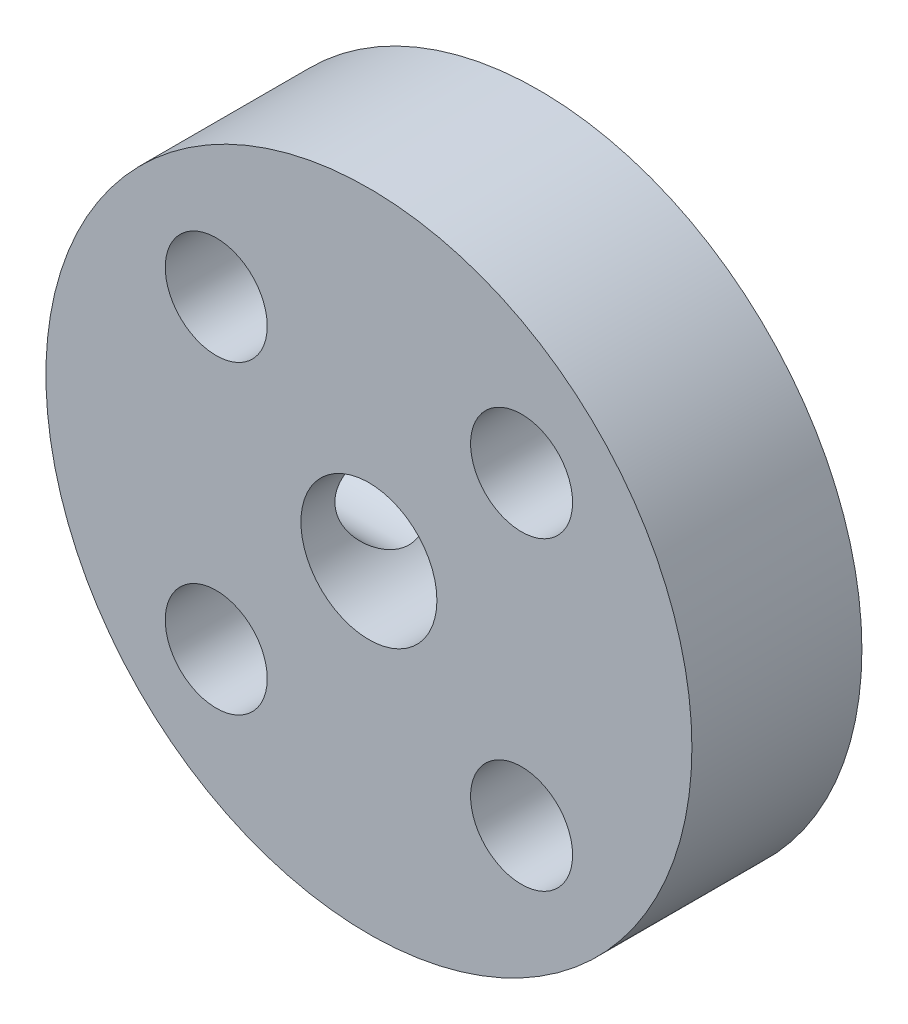
ISO-10303-21;
HEADER;
FILE_DESCRIPTION(('STEP AP214'),'2;1');
FILE_NAME('part.step','',(''),(''),'','','');
FILE_SCHEMA(('AUTOMOTIVE_DESIGN { 1 0 10303 214 1 1 1 1 }'));
ENDSEC;
DATA;
#1=APPLICATION_CONTEXT('core data for automotive mechanical design processes');
#2=APPLICATION_PROTOCOL_DEFINITION('international standard','automotive_design',2000,#1);
#3=PRODUCT_CONTEXT('',#1,'mechanical');
#4=PRODUCT('Part','Part','',(#3));
#5=PRODUCT_RELATED_PRODUCT_CATEGORY('part','',(#4));
#6=PRODUCT_DEFINITION_FORMATION('','',#4);
#7=PRODUCT_DEFINITION_CONTEXT('part definition',#1,'design');
#8=PRODUCT_DEFINITION('design','',#6,#7);
#9=PRODUCT_DEFINITION_SHAPE('','',#8);
#10=(LENGTH_UNIT() NAMED_UNIT(*) SI_UNIT(.MILLI.,.METRE.));
#11=(NAMED_UNIT(*) PLANE_ANGLE_UNIT() SI_UNIT($,.RADIAN.));
#12=(NAMED_UNIT(*) SI_UNIT($,.STERADIAN.) SOLID_ANGLE_UNIT());
#13=UNCERTAINTY_MEASURE_WITH_UNIT(LENGTH_MEASURE(1.E-05),#10,'distance_accuracy_value','');
#14=(GEOMETRIC_REPRESENTATION_CONTEXT(3) GLOBAL_UNCERTAINTY_ASSIGNED_CONTEXT((#13)) GLOBAL_UNIT_ASSIGNED_CONTEXT((#10,
#11,#12)) REPRESENTATION_CONTEXT('',''));
#15=CARTESIAN_POINT('',(0.,0.,0.));
#16=DIRECTION('',(0.,0.,1.));
#17=DIRECTION('',(1.,0.,0.));
#18=AXIS2_PLACEMENT_3D('',#15,#16,#17);
#19=CARTESIAN_POINT('',(0.,0.,2.5));
#20=DIRECTION('',(0.,0.,1.));
#21=DIRECTION('',(1.,0.,0.));
#22=AXIS2_PLACEMENT_3D('',#19,#20,#21);
#23=PLANE('',#22);
#24=CARTESIAN_POINT('',(-4.4901280605346,4.49012806053455,2.5));
#25=DIRECTION('',(0.,0.,1.));
#26=DIRECTION('',(1.,0.,0.));
#27=AXIS2_PLACEMENT_3D('',#24,#25,#26);
#28=CIRCLE('',#27,1.5);
#29=CARTESIAN_POINT('',(-2.9901280605346,4.49012806053455,2.5));
#30=VERTEX_POINT('',#29);
#31=EDGE_CURVE('E67',#30,#30,#28,.T.);
#32=ORIENTED_EDGE('',*,*,#31,.F.);
#33=EDGE_LOOP('',(#32));
#34=FACE_BOUND('',#33,.T.);
#35=CARTESIAN_POINT('',(4.49012806053454,4.49012806053462,2.5));
#36=DIRECTION('',(0.,0.,1.));
#37=DIRECTION('',(1.,0.,0.));
#38=AXIS2_PLACEMENT_3D('',#35,#36,#37);
#39=CIRCLE('',#38,1.5);
#40=CARTESIAN_POINT('',(5.99012806053454,4.49012806053462,2.5));
#41=VERTEX_POINT('',#40);
#42=EDGE_CURVE('E55',#41,#41,#39,.T.);
#43=ORIENTED_EDGE('',*,*,#42,.F.);
#44=EDGE_LOOP('',(#43));
#45=FACE_BOUND('',#44,.T.);
#46=CARTESIAN_POINT('',(0.,0.,2.5));
#47=DIRECTION('',(0.,0.,1.));
#48=DIRECTION('',(1.,0.,0.));
#49=AXIS2_PLACEMENT_3D('',#46,#47,#48);
#50=CIRCLE('',#49,9.5);
#51=CARTESIAN_POINT('',(9.5,0.,2.5));
#52=VERTEX_POINT('',#51);
#53=EDGE_CURVE('E10',#52,#52,#50,.T.);
#54=ORIENTED_EDGE('',*,*,#53,.T.);
#55=EDGE_LOOP('',(#54));
#56=FACE_BOUND('',#55,.T.);
#57=CARTESIAN_POINT('',(0.,0.,2.5));
#58=DIRECTION('',(0.,0.,1.));
#59=DIRECTION('',(1.,0.,0.));
#60=AXIS2_PLACEMENT_3D('',#57,#58,#59);
#61=CIRCLE('',#60,2.);
#62=CARTESIAN_POINT('',(2.,0.,2.5));
#63=VERTEX_POINT('',#62);
#64=EDGE_CURVE('E50',#63,#63,#61,.T.);
#65=ORIENTED_EDGE('',*,*,#64,.F.);
#66=EDGE_LOOP('',(#65));
#67=FACE_BOUND('',#66,.T.);
#68=CARTESIAN_POINT('',(4.4901280605346,-4.49012806053455,2.5));
#69=DIRECTION('',(0.,0.,1.));
#70=DIRECTION('',(1.,0.,0.));
#71=AXIS2_PLACEMENT_3D('',#68,#69,#70);
#72=CIRCLE('',#71,1.5);
#73=CARTESIAN_POINT('',(5.9901280605346,-4.49012806053455,2.5));
#74=VERTEX_POINT('',#73);
#75=EDGE_CURVE('E61',#74,#74,#72,.T.);
#76=ORIENTED_EDGE('',*,*,#75,.F.);
#77=EDGE_LOOP('',(#76));
#78=FACE_BOUND('',#77,.T.);
#79=CARTESIAN_POINT('',(-4.49012806053453,-4.49012806053462,2.5));
#80=DIRECTION('',(0.,0.,1.));
#81=DIRECTION('',(1.,0.,0.));
#82=AXIS2_PLACEMENT_3D('',#79,#80,#81);
#83=CIRCLE('',#82,1.5);
#84=CARTESIAN_POINT('',(-2.99012806053453,-4.49012806053462,2.5));
#85=VERTEX_POINT('',#84);
#86=EDGE_CURVE('E73',#85,#85,#83,.T.);
#87=ORIENTED_EDGE('',*,*,#86,.F.);
#88=EDGE_LOOP('',(#87));
#89=FACE_BOUND('',#88,.T.);
#90=ADVANCED_FACE('F31',(#34,#45,#56,#67,#78,#89),#23,.T.);
#91=CARTESIAN_POINT('',(0.,0.,-2.5));
#92=DIRECTION('',(0.,0.,1.));
#93=DIRECTION('',(1.,0.,0.));
#94=AXIS2_PLACEMENT_3D('',#91,#92,#93);
#95=PLANE('',#94);
#96=CARTESIAN_POINT('',(0.,0.,-2.5));
#97=DIRECTION('',(0.,0.,1.));
#98=DIRECTION('',(1.,0.,0.));
#99=AXIS2_PLACEMENT_3D('',#96,#97,#98);
#100=CIRCLE('',#99,9.5);
#101=CARTESIAN_POINT('',(9.5,0.,-2.5));
#102=VERTEX_POINT('',#101);
#103=EDGE_CURVE('E45',#102,#102,#100,.T.);
#104=ORIENTED_EDGE('',*,*,#103,.F.);
#105=EDGE_LOOP('',(#104));
#106=FACE_BOUND('',#105,.T.);
#107=CARTESIAN_POINT('',(0.,0.,-2.5));
#108=DIRECTION('',(0.,0.,1.));
#109=DIRECTION('',(1.,0.,0.));
#110=AXIS2_PLACEMENT_3D('',#107,#108,#109);
#111=CIRCLE('',#110,2.);
#112=CARTESIAN_POINT('',(2.,0.,-2.5));
#113=VERTEX_POINT('',#112);
#114=EDGE_CURVE('E52',#113,#113,#111,.T.);
#115=ORIENTED_EDGE('',*,*,#114,.T.);
#116=EDGE_LOOP('',(#115));
#117=FACE_BOUND('',#116,.T.);
#118=CARTESIAN_POINT('',(4.49012806053454,4.49012806053462,-2.5));
#119=DIRECTION('',(0.,0.,1.));
#120=DIRECTION('',(1.,0.,0.));
#121=AXIS2_PLACEMENT_3D('',#118,#119,#120);
#122=CIRCLE('',#121,1.5);
#123=CARTESIAN_POINT('',(5.99012806053454,4.49012806053462,-2.5));
#124=VERTEX_POINT('',#123);
#125=EDGE_CURVE('E58',#124,#124,#122,.T.);
#126=ORIENTED_EDGE('',*,*,#125,.T.);
#127=EDGE_LOOP('',(#126));
#128=FACE_BOUND('',#127,.T.);
#129=CARTESIAN_POINT('',(4.4901280605346,-4.49012806053455,-2.5));
#130=DIRECTION('',(0.,0.,1.));
#131=DIRECTION('',(1.,0.,0.));
#132=AXIS2_PLACEMENT_3D('',#129,#130,#131);
#133=CIRCLE('',#132,1.5);
#134=CARTESIAN_POINT('',(5.9901280605346,-4.49012806053455,-2.5));
#135=VERTEX_POINT('',#134);
#136=EDGE_CURVE('E64',#135,#135,#133,.T.);
#137=ORIENTED_EDGE('',*,*,#136,.T.);
#138=EDGE_LOOP('',(#137));
#139=FACE_BOUND('',#138,.T.);
#140=CARTESIAN_POINT('',(-4.4901280605346,4.49012806053455,-2.5));
#141=DIRECTION('',(0.,0.,1.));
#142=DIRECTION('',(1.,0.,0.));
#143=AXIS2_PLACEMENT_3D('',#140,#141,#142);
#144=CIRCLE('',#143,1.5);
#145=CARTESIAN_POINT('',(-2.9901280605346,4.49012806053455,-2.5));
#146=VERTEX_POINT('',#145);
#147=EDGE_CURVE('E70',#146,#146,#144,.T.);
#148=ORIENTED_EDGE('',*,*,#147,.T.);
#149=EDGE_LOOP('',(#148));
#150=FACE_BOUND('',#149,.T.);
#151=CARTESIAN_POINT('',(-4.49012806053453,-4.49012806053462,-2.5));
#152=DIRECTION('',(0.,0.,1.));
#153=DIRECTION('',(1.,0.,0.));
#154=AXIS2_PLACEMENT_3D('',#151,#152,#153);
#155=CIRCLE('',#154,1.5);
#156=CARTESIAN_POINT('',(-2.99012806053453,-4.49012806053462,-2.5));
#157=VERTEX_POINT('',#156);
#158=EDGE_CURVE('E76',#157,#157,#155,.T.);
#159=ORIENTED_EDGE('',*,*,#158,.T.);
#160=EDGE_LOOP('',(#159));
#161=FACE_BOUND('',#160,.T.);
#162=ADVANCED_FACE('F113',(#106,#117,#128,#139,#150,#161),#95,.F.);
#163=CARTESIAN_POINT('',(0.,0.,2.5));
#164=DIRECTION('',(0.,0.,-1.));
#165=DIRECTION('',(-1.,0.,0.));
#166=AXIS2_PLACEMENT_3D('',#163,#164,#165);
#167=CYLINDRICAL_SURFACE('',#166,9.5);
#168=CARTESIAN_POINT('',(-9.5,0.,1.5));
#169=CARTESIAN_POINT('',(-9.49999861203618,-0.0836976001065212,1.49999659075089));
#170=CARTESIAN_POINT('',(-9.49888234231911,-0.167442437394015,1.49297105489717));
#171=CARTESIAN_POINT('',(-9.49453678011784,-0.332587635211273,1.46506375653031));
#172=CARTESIAN_POINT('',(-9.49130548294469,-0.41398569489526,1.44416884792844));
#173=CARTESIAN_POINT('',(-9.48309267200424,-0.572023766729428,1.38916582150304));
#174=CARTESIAN_POINT('',(-9.47811253172856,-0.648667457404599,1.35506807066557));
#175=CARTESIAN_POINT('',(-9.46695108120927,-0.795134710469112,1.27465345446147));
#176=CARTESIAN_POINT('',(-9.46076992418343,-0.864959141108908,1.22833814746046));
#177=CARTESIAN_POINT('',(-9.44783324384052,-0.996418466512016,1.12437811450022));
#178=CARTESIAN_POINT('',(-9.44107365911177,-1.05798606000114,1.06664878123631));
#179=CARTESIAN_POINT('',(-9.4277734333424,-1.17060304704613,0.941681518294073));
#180=CARTESIAN_POINT('',(-9.42123280546741,-1.22165180906462,0.874443018105818));
#181=CARTESIAN_POINT('',(-9.40907168619828,-1.31204764005015,0.731909155530542));
#182=CARTESIAN_POINT('',(-9.40345644380092,-1.35132892424659,0.656571585240804));
#183=CARTESIAN_POINT('',(-9.39383775862892,-1.41665421811941,0.500264325212043));
#184=CARTESIAN_POINT('',(-9.38983421838049,-1.44269902834657,0.419294976423555));
#185=CARTESIAN_POINT('',(-9.3839324055745,-1.4806016253586,0.254733051048339));
#186=CARTESIAN_POINT('',(-9.38201697623701,-1.49257509267669,0.171167745216411));
#187=CARTESIAN_POINT('',(-9.38045626095235,-1.50235362805524,0.00319382694182367));
#188=CARTESIAN_POINT('',(-9.38081083073655,-1.50015959652364,-0.0812147315679277));
#189=CARTESIAN_POINT('',(-9.38373437383503,-1.48175980710843,-0.24765797155618));
#190=CARTESIAN_POINT('',(-9.38628290415411,-1.46568339888114,-0.329707363291587));
#191=CARTESIAN_POINT('',(-9.39327524902392,-1.4201779253579,-0.489929396074078));
#192=CARTESIAN_POINT('',(-9.39771912246498,-1.39074844516594,-0.568101916578384));
#193=CARTESIAN_POINT('',(-9.40802379337809,-1.3192392577636,-0.718741812749191));
#194=CARTESIAN_POINT('',(-9.41389065039576,-1.27710525865785,-0.791182984381051));
#195=CARTESIAN_POINT('',(-9.42637594353949,-1.1814216728908,-0.928016052090478));
#196=CARTESIAN_POINT('',(-9.43299443421262,-1.12787125747699,-0.992407363265467));
#197=CARTESIAN_POINT('',(-9.44632735425789,-1.01016734202821,-1.11206211659932));
#198=CARTESIAN_POINT('',(-9.45304203303564,-0.945902736525759,-1.16721629546965));
#199=CARTESIAN_POINT('',(-9.46574266984972,-0.808972007834444,-1.26597392142834));
#200=CARTESIAN_POINT('',(-9.4717286240395,-0.736305840302161,-1.30957730754764));
#201=CARTESIAN_POINT('',(-9.48230461469925,-0.584536306884604,-1.38400321375013));
#202=CARTESIAN_POINT('',(-9.48689366833475,-0.505428458120266,-1.4148167406315));
#203=CARTESIAN_POINT('',(-9.49415073946819,-0.343072096390924,-1.46269030700213));
#204=CARTESIAN_POINT('',(-9.49681890101704,-0.259823894418548,-1.47975137782244));
#205=CARTESIAN_POINT('',(-9.49991434597553,-0.0924923680310969,-1.4994891369157));
#206=CARTESIAN_POINT('',(-9.50036501369999,-0.00842716740137028,-1.50231593842445));
#207=CARTESIAN_POINT('',(-9.49903852875434,0.158976265712538,-1.49390417515635));
#208=CARTESIAN_POINT('',(-9.4972614527432,0.242314523112226,-1.48266609436678));
#209=CARTESIAN_POINT('',(-9.49169362069365,0.405439567370636,-1.44656841868431));
#210=CARTESIAN_POINT('',(-9.48791376028195,0.48524306279508,-1.42178250442077));
#211=CARTESIAN_POINT('',(-9.47876264558506,0.639561861197124,-1.35937083242702));
#212=CARTESIAN_POINT('',(-9.4733913096943,0.714076892756961,-1.32174441626356));
#213=CARTESIAN_POINT('',(-9.4615955819989,0.856359938682377,-1.2343715048895));
#214=CARTESIAN_POINT('',(-9.45516310943482,0.92406920731113,-1.18453045621265));
#215=CARTESIAN_POINT('',(-9.44198475905152,1.05021609132263,-1.07427399741095));
#216=CARTESIAN_POINT('',(-9.43523886095463,1.10865310573566,-1.01385790241082));
#217=CARTESIAN_POINT('',(-9.42211913600069,1.21514760920431,-0.883495734437125));
#218=CARTESIAN_POINT('',(-9.41574932753235,1.26310409838576,-0.813466686411981));
#219=CARTESIAN_POINT('',(-9.40417594303638,1.34657266649327,-0.666258687733926));
#220=CARTESIAN_POINT('',(-9.39897233289797,1.38208510941917,-0.589079946299656));
#221=CARTESIAN_POINT('',(-9.39035010587674,1.43950349612765,-0.43005588906143));
#222=CARTESIAN_POINT('',(-9.38692469878068,1.46146126125825,-0.348229668837616));
#223=CARTESIAN_POINT('',(-9.38222912838246,1.49131110199775,-0.181992332759653));
#224=CARTESIAN_POINT('',(-9.38095879863367,1.49920426388363,-0.0975814170462402));
#225=CARTESIAN_POINT('',(-9.38072387634564,1.5006729373316,0.0704216729911081));
#226=CARTESIAN_POINT('',(-9.38173369742789,1.49440732883688,0.154012465580478));
#227=CARTESIAN_POINT('',(-9.38588947240367,1.46807821019621,0.318935133020525));
#228=CARTESIAN_POINT('',(-9.38903542133398,1.44801473210917,0.400267013119254));
#229=CARTESIAN_POINT('',(-9.39709967714348,1.39471776903661,0.558311064845608));
#230=CARTESIAN_POINT('',(-9.4020163288105,1.3614965806929,0.635027473007637));
#231=CARTESIAN_POINT('',(-9.41306982252277,1.28284324745908,0.781823568325395));
#232=CARTESIAN_POINT('',(-9.41920671481076,1.23741059974182,0.851902982031102));
#233=CARTESIAN_POINT('',(-9.43209095828841,1.13505145080215,0.984240968062914));
#234=CARTESIAN_POINT('',(-9.43884411780419,1.07800762728681,1.04640824158857));
#235=CARTESIAN_POINT('',(-9.45215249855795,0.954293245344264,1.16034348055255));
#236=CARTESIAN_POINT('',(-9.45870767359521,0.887620460616888,1.21210903438498));
#237=CARTESIAN_POINT('',(-9.47092780190556,0.746056649485086,1.3040585652105));
#238=CARTESIAN_POINT('',(-9.47658704267683,0.67111768109089,1.34416948717269));
#239=CARTESIAN_POINT('',(-9.48632189921254,0.515509688205493,1.41117359654583));
#240=CARTESIAN_POINT('',(-9.49039912533837,0.434846589899646,1.43808023226726));
#241=CARTESIAN_POINT('',(-9.4955986667772,0.294869549677869,1.4719290910522));
#242=CARTESIAN_POINT('',(-9.49724053176746,0.236411965071404,1.48243924191617));
#243=CARTESIAN_POINT('',(-9.49944168248486,0.118644158414182,1.49647585408426));
#244=CARTESIAN_POINT('',(-9.5000009839395,0.0593339487629795,1.50000241684602));
#245=CARTESIAN_POINT('',(-9.5,0.,1.5));
#246=B_SPLINE_CURVE_WITH_KNOTS('',3,(#168,#169,#170,#171,#172,#173,#174,#175,#176,#177,#178,
#179,#180,#181,#182,#183,#184,#185,#186,#187,#188,#189,#190,#191,#192,#193,#194,#195,#196,#197,
#198,#199,#200,#201,#202,#203,#204,#205,#206,#207,#208,#209,#210,#211,#212,#213,#214,#215,#216,
#217,#218,#219,#220,#221,#222,#223,#224,#225,#226,#227,#228,#229,#230,#231,#232,#233,#234,#235,
#236,#237,#238,#239,#240,#241,#242,#243,#244,#245),.UNSPECIFIED.,.T.,.F.,(4,2,2,2,2,2,2,2,2,2,2,
2,2,2,2,2,2,2,2,2,2,2,2,2,2,2,2,2,2,2,2,2,2,2,2,2,2,2,4),(0.,0.250875955706267,
0.501990044469083,0.752907354824666,1.00379267580462,1.25661257446513,1.50944764769345,
1.76367086508286,2.0178787050521,2.26998174901985,2.52206877086913,2.77183199835411,
3.02160298681438,3.27245685757923,3.52332894479686,3.77698595667627,4.03064430741767,
4.28448071735229,4.53829808968867,4.78943303847652,5.0405593456862,5.2903332848928,
5.54012003389346,5.79190509693548,6.04370647245532,6.2978367744557,6.55195964228958,
6.80510484781958,7.05823050087969,7.30852987505233,7.55882866766462,7.80889409144677,
8.05896981366678,8.31171040651353,8.56450952903007,8.81886068521234,9.07295224922779,
9.25080295634069,9.42865107961775),.UNSPECIFIED.);
#247=CARTESIAN_POINT('',(-9.5,0.,1.5));
#248=VERTEX_POINT('',#247);
#249=EDGE_CURVE('E79',#248,#248,#246,.T.);
#250=ORIENTED_EDGE('',*,*,#249,.T.);
#251=EDGE_LOOP('',(#250));
#252=FACE_BOUND('',#251,.T.);
#253=ORIENTED_EDGE('',*,*,#53,.F.);
#254=EDGE_LOOP('',(#253));
#255=FACE_BOUND('',#254,.T.);
#256=ORIENTED_EDGE('',*,*,#103,.T.);
#257=EDGE_LOOP('',(#256));
#258=FACE_BOUND('',#257,.T.);
#259=ADVANCED_FACE('F33',(#252,#255,#258),#167,.T.);
#260=CARTESIAN_POINT('',(0.,0.,2.5));
#261=DIRECTION('',(0.,0.,-1.));
#262=DIRECTION('',(-1.,0.,0.));
#263=AXIS2_PLACEMENT_3D('',#260,#261,#262);
#264=CYLINDRICAL_SURFACE('',#263,2.);
#265=CARTESIAN_POINT('',(-2.,0.,1.5));
#266=CARTESIAN_POINT('',(-1.99999540196395,-0.0732207358411543,1.49999520798798));
#267=CARTESIAN_POINT('',(-1.99593645526274,-0.146561062021485,1.4945949756255));
#268=CARTESIAN_POINT('',(-1.98006607281083,-0.290936396286467,1.47333293658984));
#269=CARTESIAN_POINT('',(-1.96823514679854,-0.361965136229004,1.45744482834995));
#270=CARTESIAN_POINT('',(-1.9379567495606,-0.499234626631249,1.41628709071623));
#271=CARTESIAN_POINT('',(-1.91954951932009,-0.565501615403737,1.39107448643083));
#272=CARTESIAN_POINT('',(-1.87750556721694,-0.692422335520753,1.33245765581277));
#273=CARTESIAN_POINT('',(-1.85387037535483,-0.753077701796333,1.29905582580648));
#274=CARTESIAN_POINT('',(-1.80049544543983,-0.873465937590145,1.22173698840918));
#275=CARTESIAN_POINT('',(-1.77039308548439,-0.932593229272033,1.17713267066593));
#276=CARTESIAN_POINT('',(-1.70767017883378,-1.04302716767671,1.08050416263883));
#277=CARTESIAN_POINT('',(-1.67504578078609,-1.09432148272226,1.02846851720017));
#278=CARTESIAN_POINT('',(-1.6027112365199,-1.19837161436623,0.906417046721633));
#279=CARTESIAN_POINT('',(-1.56290854864639,-1.24930578421204,0.834896322878296));
#280=CARTESIAN_POINT('',(-1.48711444664135,-1.33861998176348,0.682548987633454));
#281=CARTESIAN_POINT('',(-1.45111786883675,-1.37701716983077,0.60173530299969));
#282=CARTESIAN_POINT('',(-1.39977155180179,-1.42880627811788,0.460497161323767));
#283=CARTESIAN_POINT('',(-1.38157751186733,-1.44625674456539,0.402609302871618));
#284=CARTESIAN_POINT('',(-1.35171594150685,-1.47420672564844,0.28360726521508));
#285=CARTESIAN_POINT('',(-1.34003347910832,-1.48472215355267,0.222500822125209));
#286=CARTESIAN_POINT('',(-1.32503759684553,-1.49812822141445,0.097817414469232));
#287=CARTESIAN_POINT('',(-1.32180026676597,-1.50094954854207,0.034223193275945));
#288=CARTESIAN_POINT('',(-1.32459531776068,-1.49848213241869,-0.0926149108815744));
#289=CARTESIAN_POINT('',(-1.33063102218113,-1.49319048157349,-0.155858660087439));
#290=CARTESIAN_POINT('',(-1.34967623262519,-1.47597739291882,-0.273191347425791));
#291=CARTESIAN_POINT('',(-1.36187157059871,-1.46482486380817,-0.327536371046185));
#292=CARTESIAN_POINT('',(-1.39114192844939,-1.43705671120732,-0.433438878720878));
#293=CARTESIAN_POINT('',(-1.40822163640769,-1.42043583681172,-0.484993627823596));
#294=CARTESIAN_POINT('',(-1.45741769294306,-1.37033064172535,-0.61625638663415));
#295=CARTESIAN_POINT('',(-1.49225649139233,-1.3328014849398,-0.693400416643509));
#296=CARTESIAN_POINT('',(-1.56533298145196,-1.24618023314519,-0.839196523869084));
#297=CARTESIAN_POINT('',(-1.60357878886109,-1.19706004255878,-0.90782733925466));
#298=CARTESIAN_POINT('',(-1.68051672313145,-1.08651604102135,-1.03775339040365));
#299=CARTESIAN_POINT('',(-1.71919586730239,-1.02481375526036,-1.09882060688148));
#300=CARTESIAN_POINT('',(-1.79248037980972,-0.890422521709589,-1.21026364678116));
#301=CARTESIAN_POINT('',(-1.8270934826376,-0.817755054293756,-1.26065992023038));
#302=CARTESIAN_POINT('',(-1.88279726073643,-0.677902080454142,-1.33998079924033));
#303=CARTESIAN_POINT('',(-1.90520770945008,-0.61253987018562,-1.37118459421578));
#304=CARTESIAN_POINT('',(-1.94372904416948,-0.476352173202086,-1.42422488046386));
#305=CARTESIAN_POINT('',(-1.95984387504352,-0.405530141063766,-1.44606723849928));
#306=CARTESIAN_POINT('',(-1.98445588635989,-0.259676232483518,-1.47925336288644));
#307=CARTESIAN_POINT('',(-1.99290592971749,-0.184621281405943,-1.49053217893863));
#308=CARTESIAN_POINT('',(-2.00115883659445,-0.033201239796917,-1.50154959737171));
#309=CARTESIAN_POINT('',(-2.00096534845408,0.0431632843727237,-1.50129306869537));
#310=CARTESIAN_POINT('',(-1.99242547175873,0.186804217329625,-1.48988913072681));
#311=CARTESIAN_POINT('',(-1.98490086600401,0.254222327546133,-1.47983946311133));
#312=CARTESIAN_POINT('',(-1.96351320201588,0.386110670609118,-1.45102621999213));
#313=CARTESIAN_POINT('',(-1.94964879507262,0.450580272987261,-1.43226079031059));
#314=CARTESIAN_POINT('',(-1.91599830683313,0.577416779689769,-1.3861124694069));
#315=CARTESIAN_POINT('',(-1.89602050290193,0.639629172536139,-1.3584488185726));
#316=CARTESIAN_POINT('',(-1.85166985411963,0.758518527043073,-1.29582754457441));
#317=CARTESIAN_POINT('',(-1.82729640132068,0.815194721336403,-1.26086891236026));
#318=CARTESIAN_POINT('',(-1.77119146886499,0.931511626319037,-1.17821675358944));
#319=CARTESIAN_POINT('',(-1.73891095025037,0.990066762698701,-1.12937146056255));
#320=CARTESIAN_POINT('',(-1.67238952874785,1.09871974855854,-1.02399124741161));
#321=CARTESIAN_POINT('',(-1.63814438507395,1.14879830469577,-0.967439300306642));
#322=CARTESIAN_POINT('',(-1.56369128291497,1.24877541075626,-0.835850119038824));
#323=CARTESIAN_POINT('',(-1.523587185201,1.29683043648705,-0.759342438507699));
#324=CARTESIAN_POINT('',(-1.4494059134845,1.37923235998283,-0.596639922027547));
#325=CARTESIAN_POINT('',(-1.41531099570969,1.41362000515519,-0.510474878091426));
#326=CARTESIAN_POINT('',(-1.37118877808583,1.45615734256767,-0.364585551125524));
#327=CARTESIAN_POINT('',(-1.35695811824564,1.46931009512996,-0.307608873597618));
#328=CARTESIAN_POINT('',(-1.33542056103011,1.48891522181906,-0.191292953016818));
#329=CARTESIAN_POINT('',(-1.32809821220233,1.4953825519924,-0.131959293197748));
#330=CARTESIAN_POINT('',(-1.32157601792209,1.50115320209064,-0.0121709201886709));
#331=CARTESIAN_POINT('',(-1.32241740684975,1.50042015325262,0.0482879430095728));
#332=CARTESIAN_POINT('',(-1.33216448543666,1.49176883838219,0.168056838752158));
#333=CARTESIAN_POINT('',(-1.34108058157484,1.48384130024585,0.227365287897258));
#334=CARTESIAN_POINT('',(-1.36817348797773,1.45893841819723,0.355914571410801));
#335=CARTESIAN_POINT('',(-1.38794705950643,1.44036567954111,0.424497180132775));
#336=CARTESIAN_POINT('',(-1.4338296338541,1.39469627266119,0.556534848830486));
#337=CARTESIAN_POINT('',(-1.4599546014693,1.3675780729773,0.619976442038189));
#338=CARTESIAN_POINT('',(-1.52516477328824,1.29498918933642,0.762520630486334));
#339=CARTESIAN_POINT('',(-1.56560203191105,1.2464154206597,0.839421582755755));
#340=CARTESIAN_POINT('',(-1.64713510181273,1.13650718465936,0.983126044977565));
#341=CARTESIAN_POINT('',(-1.68823146954222,1.07516134758577,1.04992046594485));
#342=CARTESIAN_POINT('',(-1.76728988939793,0.939627144937891,1.17283184228333));
#343=CARTESIAN_POINT('',(-1.80522333711072,0.865337161562861,1.22885631937719));
#344=CARTESIAN_POINT('',(-1.87357289668097,0.705159098936204,1.32722305114535));
#345=CARTESIAN_POINT('',(-1.90400691592959,0.619299420401794,1.36959797457251));
#346=CARTESIAN_POINT('',(-1.94636704624048,0.464840290356454,1.42779942098571));
#347=CARTESIAN_POINT('',(-1.96110322499718,0.398553614774732,1.44776673137618));
#348=CARTESIAN_POINT('',(-1.98383739970238,0.26284161039276,1.47841790261149));
#349=CARTESIAN_POINT('',(-1.99185421210894,0.193425623834906,1.48912769024996));
#350=CARTESIAN_POINT('',(-1.99745471706309,0.102963309861889,1.49660469421435));
#351=CARTESIAN_POINT('',(-1.9984076143208,0.0824069459941234,1.49787627748942));
#352=CARTESIAN_POINT('',(-1.99968095423138,0.0412368896243778,1.49957467323097));
#353=CARTESIAN_POINT('',(-2.00000129507253,0.0206231884283879,1.50000134970737));
#354=CARTESIAN_POINT('',(-2.,0.,1.5));
#355=B_SPLINE_CURVE_WITH_KNOTS('',3,(#265,#266,#267,#268,#269,#270,#271,#272,#273,#274,#275,
#276,#277,#278,#279,#280,#281,#282,#283,#284,#285,#286,#287,#288,#289,#290,#291,#292,#293,#294,
#295,#296,#297,#298,#299,#300,#301,#302,#303,#304,#305,#306,#307,#308,#309,#310,#311,#312,#313,
#314,#315,#316,#317,#318,#319,#320,#321,#322,#323,#324,#325,#326,#327,#328,#329,#330,#331,#332,
#333,#334,#335,#336,#337,#338,#339,#340,#341,#342,#343,#344,#345,#346,#347,#348,#349,#350,#351,
#352,#353,#354),.UNSPECIFIED.,.T.,.F.,(4,2,2,2,2,2,2,2,2,2,2,2,2,2,2,2,2,2,2,2,2,2,2,2,2,2,2,2,
2,2,2,2,2,2,2,2,2,2,2,2,2,2,2,2,4),(0.,0.219571786572042,0.439696319423244,0.658496333573382,
0.877232398849293,1.1162243131743,1.35558868405162,1.64360015887451,1.93121574056507,
2.11999518529902,2.3083399319529,2.49837587621257,2.6884799430021,2.85826890162709,
3.0282213760064,3.3044933180591,3.58144192357889,3.86535883938091,4.14872662493691,
4.37526505006389,4.60166129643117,4.82944058166899,5.05712372466613,5.26191187011994,
5.46674360185812,5.6788043948368,5.89089453977541,6.13840382081868,6.38646908985452,
6.68168596015947,6.97601595850113,7.15589161422933,7.33536399114208,7.51574333854741,
7.69635548563854,7.91639670960135,8.13699685139922,8.43412246655768,8.73151372390893,
9.0313544949265,9.33047220273164,9.5419569754163,9.75284752283257,9.81468166878711,
9.87652576630966),.UNSPECIFIED.);
#356=CARTESIAN_POINT('',(-2.,0.,1.5));
#357=VERTEX_POINT('',#356);
#358=EDGE_CURVE('E36',#357,#357,#355,.T.);
#359=ORIENTED_EDGE('',*,*,#358,.F.);
#360=EDGE_LOOP('',(#359));
#361=FACE_BOUND('',#360,.T.);
#362=ORIENTED_EDGE('',*,*,#64,.T.);
#363=EDGE_LOOP('',(#362));
#364=FACE_BOUND('',#363,.T.);
#365=ORIENTED_EDGE('',*,*,#114,.F.);
#366=EDGE_LOOP('',(#365));
#367=FACE_BOUND('',#366,.T.);
#368=ADVANCED_FACE('F106',(#361,#364,#367),#264,.F.);
#369=CARTESIAN_POINT('',(4.49012806053454,4.49012806053462,2.5));
#370=DIRECTION('',(0.,0.,-1.));
#371=DIRECTION('',(-1.,0.,0.));
#372=AXIS2_PLACEMENT_3D('',#369,#370,#371);
#373=CYLINDRICAL_SURFACE('',#372,1.5);
#374=ORIENTED_EDGE('',*,*,#42,.T.);
#375=EDGE_LOOP('',(#374));
#376=FACE_BOUND('',#375,.T.);
#377=ORIENTED_EDGE('',*,*,#125,.F.);
#378=EDGE_LOOP('',(#377));
#379=FACE_BOUND('',#378,.T.);
#380=ADVANCED_FACE('F103',(#376,#379),#373,.F.);
#381=CARTESIAN_POINT('',(4.4901280605346,-4.49012806053455,2.5));
#382=DIRECTION('',(0.,0.,-1.));
#383=DIRECTION('',(-1.,0.,0.));
#384=AXIS2_PLACEMENT_3D('',#381,#382,#383);
#385=CYLINDRICAL_SURFACE('',#384,1.5);
#386=ORIENTED_EDGE('',*,*,#75,.T.);
#387=EDGE_LOOP('',(#386));
#388=FACE_BOUND('',#387,.T.);
#389=ORIENTED_EDGE('',*,*,#136,.F.);
#390=EDGE_LOOP('',(#389));
#391=FACE_BOUND('',#390,.T.);
#392=ADVANCED_FACE('F99',(#388,#391),#385,.F.);
#393=CARTESIAN_POINT('',(-4.4901280605346,4.49012806053455,2.5));
#394=DIRECTION('',(0.,0.,-1.));
#395=DIRECTION('',(-1.,0.,0.));
#396=AXIS2_PLACEMENT_3D('',#393,#394,#395);
#397=CYLINDRICAL_SURFACE('',#396,1.5);
#398=ORIENTED_EDGE('',*,*,#31,.T.);
#399=EDGE_LOOP('',(#398));
#400=FACE_BOUND('',#399,.T.);
#401=ORIENTED_EDGE('',*,*,#147,.F.);
#402=EDGE_LOOP('',(#401));
#403=FACE_BOUND('',#402,.T.);
#404=ADVANCED_FACE('F95',(#400,#403),#397,.F.);
#405=CARTESIAN_POINT('',(-4.49012806053453,-4.49012806053462,2.5));
#406=DIRECTION('',(0.,0.,-1.));
#407=DIRECTION('',(-1.,0.,0.));
#408=AXIS2_PLACEMENT_3D('',#405,#406,#407);
#409=CYLINDRICAL_SURFACE('',#408,1.5);
#410=ORIENTED_EDGE('',*,*,#86,.T.);
#411=EDGE_LOOP('',(#410));
#412=FACE_BOUND('',#411,.T.);
#413=ORIENTED_EDGE('',*,*,#158,.F.);
#414=EDGE_LOOP('',(#413));
#415=FACE_BOUND('',#414,.T.);
#416=ADVANCED_FACE('F90',(#412,#415),#409,.F.);
#417=CARTESIAN_POINT('',(-16.,0.,0.));
#418=DIRECTION('',(1.,0.,0.));
#419=DIRECTION('',(0.,0.,-1.));
#420=AXIS2_PLACEMENT_3D('',#417,#418,#419);
#421=CYLINDRICAL_SURFACE('',#420,1.5);
#422=ORIENTED_EDGE('',*,*,#358,.T.);
#423=EDGE_LOOP('',(#422));
#424=FACE_BOUND('',#423,.T.);
#425=ORIENTED_EDGE('',*,*,#249,.F.);
#426=EDGE_LOOP('',(#425));
#427=FACE_BOUND('',#426,.T.);
#428=ADVANCED_FACE('F86',(#424,#427),#421,.F.);
#429=CLOSED_SHELL('',(#90,#162,#259,#368,#380,#392,#404,#416,#428));
#430=MANIFOLD_SOLID_BREP('B2',#429);
#431=ADVANCED_BREP_SHAPE_REPRESENTATION('',(#18,#430),#14);
#432=SHAPE_DEFINITION_REPRESENTATION(#9,#431);
ENDSEC;
END-ISO-10303-21;
